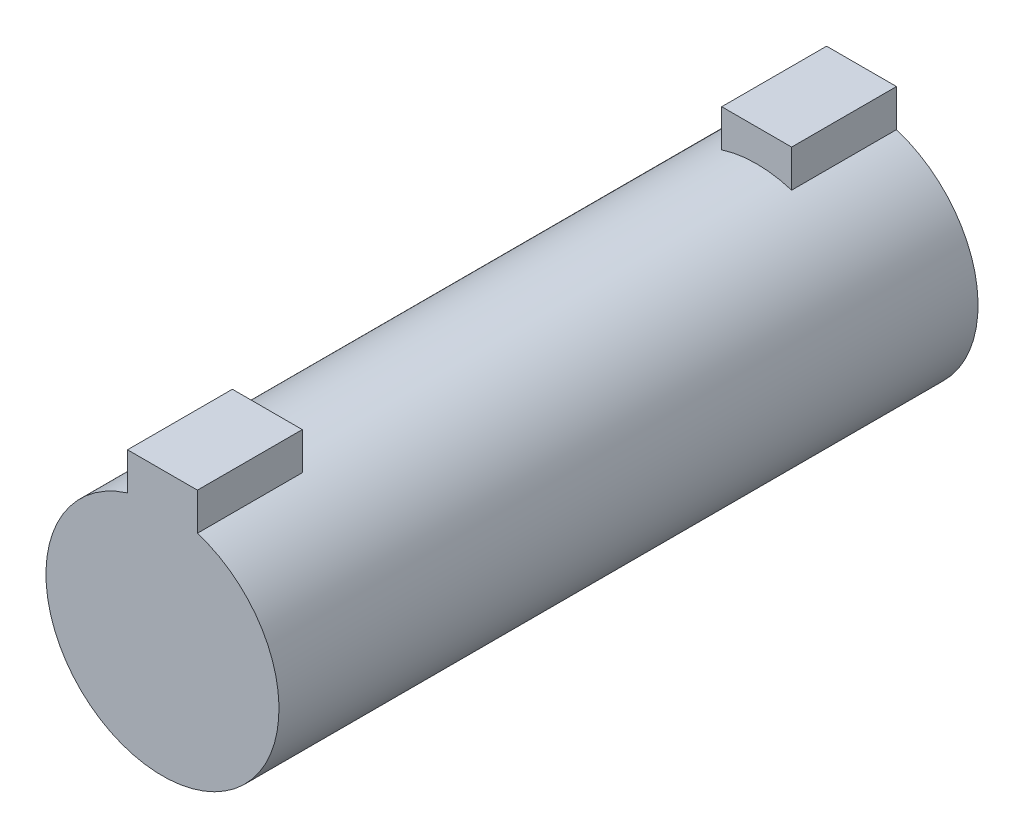
ISO-10303-21;
HEADER;
FILE_DESCRIPTION(('STEP AP214'),'2;1');
FILE_NAME('part.step','',(''),(''),'','','');
FILE_SCHEMA(('AUTOMOTIVE_DESIGN { 1 0 10303 214 1 1 1 1 }'));
ENDSEC;
DATA;
#1=APPLICATION_CONTEXT('core data for automotive mechanical design processes');
#2=APPLICATION_PROTOCOL_DEFINITION('international standard','automotive_design',2000,#1);
#3=PRODUCT_CONTEXT('',#1,'mechanical');
#4=PRODUCT('Part','Part','',(#3));
#5=PRODUCT_RELATED_PRODUCT_CATEGORY('part','',(#4));
#6=PRODUCT_DEFINITION_FORMATION('','',#4);
#7=PRODUCT_DEFINITION_CONTEXT('part definition',#1,'design');
#8=PRODUCT_DEFINITION('design','',#6,#7);
#9=PRODUCT_DEFINITION_SHAPE('','',#8);
#10=(LENGTH_UNIT() NAMED_UNIT(*) SI_UNIT(.MILLI.,.METRE.));
#11=(NAMED_UNIT(*) PLANE_ANGLE_UNIT() SI_UNIT($,.RADIAN.));
#12=(NAMED_UNIT(*) SI_UNIT($,.STERADIAN.) SOLID_ANGLE_UNIT());
#13=UNCERTAINTY_MEASURE_WITH_UNIT(LENGTH_MEASURE(1.E-05),#10,'distance_accuracy_value','');
#14=(GEOMETRIC_REPRESENTATION_CONTEXT(3) GLOBAL_UNCERTAINTY_ASSIGNED_CONTEXT((#13)) GLOBAL_UNIT_ASSIGNED_CONTEXT((#10,
#11,#12)) REPRESENTATION_CONTEXT('',''));
#15=CARTESIAN_POINT('',(0.,0.,0.));
#16=DIRECTION('',(0.,0.,1.));
#17=DIRECTION('',(1.,0.,0.));
#18=AXIS2_PLACEMENT_3D('',#15,#16,#17);
#19=CARTESIAN_POINT('',(0.,0.,30.));
#20=DIRECTION('',(0.,0.,-1.));
#21=DIRECTION('',(-1.,0.,0.));
#22=AXIS2_PLACEMENT_3D('',#19,#20,#21);
#23=CYLINDRICAL_SURFACE('',#22,10.);
#24=CARTESIAN_POINT('',(0.,0.,30.));
#25=DIRECTION('',(0.,0.,1.));
#26=DIRECTION('',(1.,0.,0.));
#27=AXIS2_PLACEMENT_3D('',#24,#25,#26);
#28=CIRCLE('',#27,10.);
#29=CARTESIAN_POINT('',(-3.,9.53939201416946,30.));
#30=VERTEX_POINT('',#29);
#31=CARTESIAN_POINT('',(3.,9.53939201416946,30.));
#32=VERTEX_POINT('',#31);
#33=EDGE_CURVE('E161',#30,#32,#28,.T.);
#34=ORIENTED_EDGE('',*,*,#33,.F.);
#35=DIRECTION('',(0.,0.,-1.));
#36=VECTOR('',#35,1.);
#37=CARTESIAN_POINT('',(-3.,9.53939201416945,30.));
#38=LINE('',#37,#36);
#39=CARTESIAN_POINT('',(-3.,9.53939201416945,21.));
#40=VERTEX_POINT('',#39);
#41=EDGE_CURVE('E157',#30,#40,#38,.T.);
#42=ORIENTED_EDGE('',*,*,#41,.T.);
#43=CARTESIAN_POINT('',(0.,0.,21.));
#44=DIRECTION('',(0.,0.,-1.));
#45=DIRECTION('',(-1.,0.,0.));
#46=AXIS2_PLACEMENT_3D('',#43,#44,#45);
#47=CIRCLE('',#46,10.);
#48=CARTESIAN_POINT('',(3.,9.53939201416946,21.));
#49=VERTEX_POINT('',#48);
#50=EDGE_CURVE('E46',#40,#49,#47,.T.);
#51=ORIENTED_EDGE('',*,*,#50,.T.);
#52=DIRECTION('',(0.,0.,-1.));
#53=VECTOR('',#52,1.);
#54=CARTESIAN_POINT('',(3.,9.53939201416946,30.));
#55=LINE('',#54,#53);
#56=EDGE_CURVE('E152',#49,#32,#55,.F.);
#57=ORIENTED_EDGE('',*,*,#56,.T.);
#58=EDGE_LOOP('',(#34,#42,#51,#57));
#59=FACE_BOUND('',#58,.T.);
#60=DIRECTION('',(0.,0.,-1.));
#61=VECTOR('',#60,1.);
#62=CARTESIAN_POINT('',(-3.,9.53939201416945,30.));
#63=LINE('',#62,#61);
#64=CARTESIAN_POINT('',(-3.,9.53939201416946,-30.));
#65=VERTEX_POINT('',#64);
#66=CARTESIAN_POINT('',(-3.,9.53939201416945,-21.));
#67=VERTEX_POINT('',#66);
#68=EDGE_CURVE('E122',#65,#67,#63,.F.);
#69=ORIENTED_EDGE('',*,*,#68,.F.);
#70=CARTESIAN_POINT('',(0.,0.,-30.));
#71=DIRECTION('',(0.,0.,1.));
#72=DIRECTION('',(1.,0.,0.));
#73=AXIS2_PLACEMENT_3D('',#70,#71,#72);
#74=CIRCLE('',#73,10.);
#75=CARTESIAN_POINT('',(3.,9.53939201416946,-30.));
#76=VERTEX_POINT('',#75);
#77=EDGE_CURVE('E160',#65,#76,#74,.T.);
#78=ORIENTED_EDGE('',*,*,#77,.T.);
#79=DIRECTION('',(0.,0.,-1.));
#80=VECTOR('',#79,1.);
#81=CARTESIAN_POINT('',(3.,9.53939201416946,30.));
#82=LINE('',#81,#80);
#83=CARTESIAN_POINT('',(3.,9.53939201416946,-21.));
#84=VERTEX_POINT('',#83);
#85=EDGE_CURVE('E56',#84,#76,#82,.T.);
#86=ORIENTED_EDGE('',*,*,#85,.F.);
#87=CARTESIAN_POINT('',(0.,0.,-21.));
#88=DIRECTION('',(0.,0.,1.));
#89=DIRECTION('',(1.,0.,0.));
#90=AXIS2_PLACEMENT_3D('',#87,#88,#89);
#91=CIRCLE('',#90,10.);
#92=EDGE_CURVE('E11',#84,#67,#91,.T.);
#93=ORIENTED_EDGE('',*,*,#92,.T.);
#94=EDGE_LOOP('',(#69,#78,#86,#93));
#95=FACE_BOUND('',#94,.T.);
#96=ADVANCED_FACE('F39',(#59,#95),#23,.T.);
#97=CARTESIAN_POINT('',(0.,0.,30.));
#98=DIRECTION('',(0.,0.,1.));
#99=DIRECTION('',(1.,0.,0.));
#100=AXIS2_PLACEMENT_3D('',#97,#98,#99);
#101=PLANE('',#100);
#102=ORIENTED_EDGE('',*,*,#33,.T.);
#103=DIRECTION('',(0.,1.,0.));
#104=VECTOR('',#103,1.);
#105=CARTESIAN_POINT('',(3.,12.745019423315,30.));
#106=LINE('',#105,#104);
#107=CARTESIAN_POINT('',(3.,12.745019423315,30.));
#108=VERTEX_POINT('',#107);
#109=EDGE_CURVE('E146',#32,#108,#106,.T.);
#110=ORIENTED_EDGE('',*,*,#109,.T.);
#111=DIRECTION('',(-1.,0.,0.));
#112=VECTOR('',#111,1.);
#113=CARTESIAN_POINT('',(3.,12.745019423315,30.));
#114=LINE('',#113,#112);
#115=CARTESIAN_POINT('',(-3.,12.745019423315,30.));
#116=VERTEX_POINT('',#115);
#117=EDGE_CURVE('E139',#108,#116,#114,.T.);
#118=ORIENTED_EDGE('',*,*,#117,.T.);
#119=DIRECTION('',(0.,-1.,0.));
#120=VECTOR('',#119,1.);
#121=CARTESIAN_POINT('',(-3.,12.745019423315,30.));
#122=LINE('',#121,#120);
#123=EDGE_CURVE('E134',#116,#30,#122,.T.);
#124=ORIENTED_EDGE('',*,*,#123,.T.);
#125=EDGE_LOOP('',(#102,#110,#118,#124));
#126=FACE_BOUND('',#125,.T.);
#127=ADVANCED_FACE('F183',(#126),#101,.T.);
#128=CARTESIAN_POINT('',(0.,0.,-30.));
#129=DIRECTION('',(0.,0.,1.));
#130=DIRECTION('',(1.,0.,0.));
#131=AXIS2_PLACEMENT_3D('',#128,#129,#130);
#132=PLANE('',#131);
#133=ORIENTED_EDGE('',*,*,#77,.F.);
#134=DIRECTION('',(0.,-1.,0.));
#135=VECTOR('',#134,1.);
#136=CARTESIAN_POINT('',(-3.,12.745019423315,-30.));
#137=LINE('',#136,#135);
#138=CARTESIAN_POINT('',(-3.,12.745019423315,-30.));
#139=VERTEX_POINT('',#138);
#140=EDGE_CURVE('E128',#139,#65,#137,.T.);
#141=ORIENTED_EDGE('',*,*,#140,.F.);
#142=DIRECTION('',(-1.,0.,0.));
#143=VECTOR('',#142,1.);
#144=CARTESIAN_POINT('',(3.,12.745019423315,-30.));
#145=LINE('',#144,#143);
#146=CARTESIAN_POINT('',(3.,12.745019423315,-30.));
#147=VERTEX_POINT('',#146);
#148=EDGE_CURVE('E115',#147,#139,#145,.T.);
#149=ORIENTED_EDGE('',*,*,#148,.F.);
#150=DIRECTION('',(0.,1.,0.));
#151=VECTOR('',#150,1.);
#152=CARTESIAN_POINT('',(3.,12.745019423315,-30.));
#153=LINE('',#152,#151);
#154=EDGE_CURVE('E123',#76,#147,#153,.T.);
#155=ORIENTED_EDGE('',*,*,#154,.F.);
#156=EDGE_LOOP('',(#133,#141,#149,#155));
#157=FACE_BOUND('',#156,.T.);
#158=ADVANCED_FACE('F185',(#157),#132,.F.);
#159=CARTESIAN_POINT('',(-3.,12.745019423315,21.));
#160=DIRECTION('',(-1.,0.,0.));
#161=DIRECTION('',(0.,0.,1.));
#162=AXIS2_PLACEMENT_3D('',#159,#160,#161);
#163=PLANE('',#162);
#164=ORIENTED_EDGE('',*,*,#41,.F.);
#165=ORIENTED_EDGE('',*,*,#123,.F.);
#166=DIRECTION('',(0.,0.,1.));
#167=VECTOR('',#166,1.);
#168=CARTESIAN_POINT('',(-3.,12.745019423315,21.));
#169=LINE('',#168,#167);
#170=CARTESIAN_POINT('',(-3.,12.745019423315,21.));
#171=VERTEX_POINT('',#170);
#172=EDGE_CURVE('E150',#171,#116,#169,.T.);
#173=ORIENTED_EDGE('',*,*,#172,.F.);
#174=DIRECTION('',(0.,-1.,0.));
#175=VECTOR('',#174,1.);
#176=CARTESIAN_POINT('',(-3.,12.745019423315,21.));
#177=LINE('',#176,#175);
#178=EDGE_CURVE('E135',#171,#40,#177,.T.);
#179=ORIENTED_EDGE('',*,*,#178,.T.);
#180=EDGE_LOOP('',(#164,#165,#173,#179));
#181=FACE_BOUND('',#180,.T.);
#182=ADVANCED_FACE('F174',(#181),#163,.T.);
#183=CARTESIAN_POINT('',(3.,12.745019423315,21.));
#184=DIRECTION('',(1.,0.,0.));
#185=DIRECTION('',(0.,0.,-1.));
#186=AXIS2_PLACEMENT_3D('',#183,#184,#185);
#187=PLANE('',#186);
#188=ORIENTED_EDGE('',*,*,#56,.F.);
#189=DIRECTION('',(0.,1.,0.));
#190=VECTOR('',#189,1.);
#191=CARTESIAN_POINT('',(3.,12.745019423315,21.));
#192=LINE('',#191,#190);
#193=CARTESIAN_POINT('',(3.,12.745019423315,21.));
#194=VERTEX_POINT('',#193);
#195=EDGE_CURVE('E138',#49,#194,#192,.T.);
#196=ORIENTED_EDGE('',*,*,#195,.T.);
#197=DIRECTION('',(0.,0.,1.));
#198=VECTOR('',#197,1.);
#199=CARTESIAN_POINT('',(3.,12.745019423315,21.));
#200=LINE('',#199,#198);
#201=EDGE_CURVE('E144',#194,#108,#200,.T.);
#202=ORIENTED_EDGE('',*,*,#201,.T.);
#203=ORIENTED_EDGE('',*,*,#109,.F.);
#204=EDGE_LOOP('',(#188,#196,#202,#203));
#205=FACE_BOUND('',#204,.T.);
#206=ADVANCED_FACE('F181',(#205),#187,.T.);
#207=CARTESIAN_POINT('',(3.,12.745019423315,21.));
#208=DIRECTION('',(0.,1.,0.));
#209=DIRECTION('',(0.,0.,1.));
#210=AXIS2_PLACEMENT_3D('',#207,#208,#209);
#211=PLANE('',#210);
#212=ORIENTED_EDGE('',*,*,#117,.F.);
#213=ORIENTED_EDGE('',*,*,#201,.F.);
#214=DIRECTION('',(-1.,0.,0.));
#215=VECTOR('',#214,1.);
#216=CARTESIAN_POINT('',(3.,12.745019423315,21.));
#217=LINE('',#216,#215);
#218=EDGE_CURVE('E141',#194,#171,#217,.T.);
#219=ORIENTED_EDGE('',*,*,#218,.T.);
#220=ORIENTED_EDGE('',*,*,#172,.T.);
#221=EDGE_LOOP('',(#212,#213,#219,#220));
#222=FACE_BOUND('',#221,.T.);
#223=ADVANCED_FACE('F178',(#222),#211,.T.);
#224=CARTESIAN_POINT('',(0.,0.,21.));
#225=DIRECTION('',(0.,0.,-1.));
#226=DIRECTION('',(-1.,0.,0.));
#227=AXIS2_PLACEMENT_3D('',#224,#225,#226);
#228=PLANE('',#227);
#229=ORIENTED_EDGE('',*,*,#50,.F.);
#230=ORIENTED_EDGE('',*,*,#178,.F.);
#231=ORIENTED_EDGE('',*,*,#218,.F.);
#232=ORIENTED_EDGE('',*,*,#195,.F.);
#233=EDGE_LOOP('',(#229,#230,#231,#232));
#234=FACE_BOUND('',#233,.T.);
#235=ADVANCED_FACE('F171',(#234),#228,.T.);
#236=CARTESIAN_POINT('',(-3.,12.745019423315,-21.));
#237=DIRECTION('',(1.,0.,0.));
#238=DIRECTION('',(0.,0.,-1.));
#239=AXIS2_PLACEMENT_3D('',#236,#237,#238);
#240=PLANE('',#239);
#241=ORIENTED_EDGE('',*,*,#140,.T.);
#242=ORIENTED_EDGE('',*,*,#68,.T.);
#243=DIRECTION('',(0.,-1.,0.));
#244=VECTOR('',#243,1.);
#245=CARTESIAN_POINT('',(-3.,12.745019423315,-21.));
#246=LINE('',#245,#244);
#247=CARTESIAN_POINT('',(-3.,12.745019423315,-21.));
#248=VERTEX_POINT('',#247);
#249=EDGE_CURVE('E104',#248,#67,#246,.T.);
#250=ORIENTED_EDGE('',*,*,#249,.F.);
#251=DIRECTION('',(0.,0.,-1.));
#252=VECTOR('',#251,1.);
#253=CARTESIAN_POINT('',(-3.,12.745019423315,-21.));
#254=LINE('',#253,#252);
#255=EDGE_CURVE('E112',#248,#139,#254,.T.);
#256=ORIENTED_EDGE('',*,*,#255,.T.);
#257=EDGE_LOOP('',(#241,#242,#250,#256));
#258=FACE_BOUND('',#257,.T.);
#259=ADVANCED_FACE('F121',(#258),#240,.F.);
#260=CARTESIAN_POINT('',(3.,12.745019423315,-21.));
#261=DIRECTION('',(-1.,0.,0.));
#262=DIRECTION('',(0.,0.,1.));
#263=AXIS2_PLACEMENT_3D('',#260,#261,#262);
#264=PLANE('',#263);
#265=DIRECTION('',(0.,1.,0.));
#266=VECTOR('',#265,1.);
#267=CARTESIAN_POINT('',(3.,12.745019423315,-21.));
#268=LINE('',#267,#266);
#269=CARTESIAN_POINT('',(3.,12.745019423315,-21.));
#270=VERTEX_POINT('',#269);
#271=EDGE_CURVE('E106',#84,#270,#268,.T.);
#272=ORIENTED_EDGE('',*,*,#271,.F.);
#273=ORIENTED_EDGE('',*,*,#85,.T.);
#274=ORIENTED_EDGE('',*,*,#154,.T.);
#275=DIRECTION('',(0.,0.,-1.));
#276=VECTOR('',#275,1.);
#277=CARTESIAN_POINT('',(3.,12.745019423315,-21.));
#278=LINE('',#277,#276);
#279=EDGE_CURVE('E119',#270,#147,#278,.T.);
#280=ORIENTED_EDGE('',*,*,#279,.F.);
#281=EDGE_LOOP('',(#272,#273,#274,#280));
#282=FACE_BOUND('',#281,.T.);
#283=ADVANCED_FACE('F203',(#282),#264,.F.);
#284=CARTESIAN_POINT('',(3.,12.745019423315,-21.));
#285=DIRECTION('',(0.,-1.,0.));
#286=DIRECTION('',(0.,0.,-1.));
#287=AXIS2_PLACEMENT_3D('',#284,#285,#286);
#288=PLANE('',#287);
#289=ORIENTED_EDGE('',*,*,#148,.T.);
#290=ORIENTED_EDGE('',*,*,#255,.F.);
#291=DIRECTION('',(-1.,0.,0.));
#292=VECTOR('',#291,1.);
#293=CARTESIAN_POINT('',(3.,12.745019423315,-21.));
#294=LINE('',#293,#292);
#295=EDGE_CURVE('E100',#270,#248,#294,.T.);
#296=ORIENTED_EDGE('',*,*,#295,.F.);
#297=ORIENTED_EDGE('',*,*,#279,.T.);
#298=EDGE_LOOP('',(#289,#290,#296,#297));
#299=FACE_BOUND('',#298,.T.);
#300=ADVANCED_FACE('F113',(#299),#288,.F.);
#301=CARTESIAN_POINT('',(0.,0.,-21.));
#302=DIRECTION('',(0.,0.,1.));
#303=DIRECTION('',(-1.,0.,0.));
#304=AXIS2_PLACEMENT_3D('',#301,#302,#303);
#305=PLANE('',#304);
#306=ORIENTED_EDGE('',*,*,#92,.F.);
#307=ORIENTED_EDGE('',*,*,#271,.T.);
#308=ORIENTED_EDGE('',*,*,#295,.T.);
#309=ORIENTED_EDGE('',*,*,#249,.T.);
#310=EDGE_LOOP('',(#306,#307,#308,#309));
#311=FACE_BOUND('',#310,.T.);
#312=ADVANCED_FACE('F102',(#311),#305,.T.);
#313=CLOSED_SHELL('',(#96,#127,#158,#182,#206,#223,#235,#259,#283,#300,#312));
#314=MANIFOLD_SOLID_BREP('B2',#313);
#315=ADVANCED_BREP_SHAPE_REPRESENTATION('',(#18,#314),#14);
#316=SHAPE_DEFINITION_REPRESENTATION(#9,#315);
ENDSEC;
END-ISO-10303-21;
